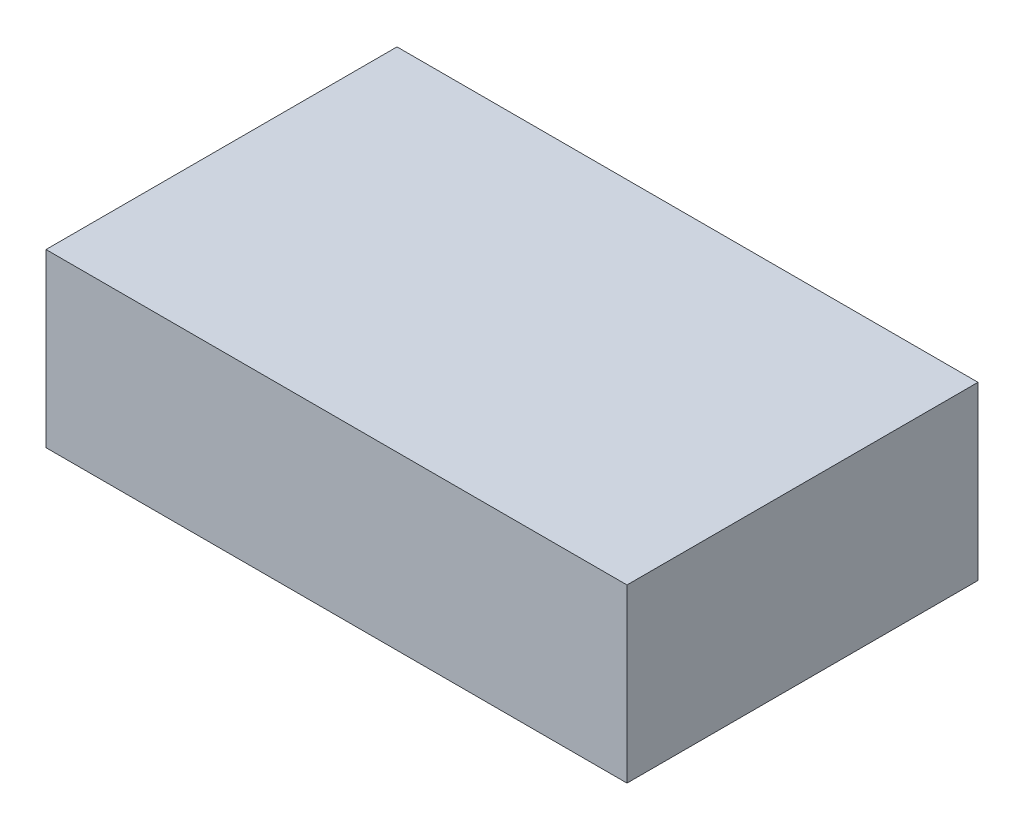
ISO-10303-21;
HEADER;
FILE_DESCRIPTION(('STEP AP214'),'2;1');
FILE_NAME('part.step','',(''),(''),'','','');
FILE_SCHEMA(('AUTOMOTIVE_DESIGN { 1 0 10303 214 1 1 1 1 }'));
ENDSEC;
DATA;
#1=APPLICATION_CONTEXT('core data for automotive mechanical design processes');
#2=APPLICATION_PROTOCOL_DEFINITION('international standard','automotive_design',2000,#1);
#3=PRODUCT_CONTEXT('',#1,'mechanical');
#4=PRODUCT('Part','Part','',(#3));
#5=PRODUCT_RELATED_PRODUCT_CATEGORY('part','',(#4));
#6=PRODUCT_DEFINITION_FORMATION('','',#4);
#7=PRODUCT_DEFINITION_CONTEXT('part definition',#1,'design');
#8=PRODUCT_DEFINITION('design','',#6,#7);
#9=PRODUCT_DEFINITION_SHAPE('','',#8);
#10=(LENGTH_UNIT() NAMED_UNIT(*) SI_UNIT(.MILLI.,.METRE.));
#11=(NAMED_UNIT(*) PLANE_ANGLE_UNIT() SI_UNIT($,.RADIAN.));
#12=(NAMED_UNIT(*) SI_UNIT($,.STERADIAN.) SOLID_ANGLE_UNIT());
#13=UNCERTAINTY_MEASURE_WITH_UNIT(LENGTH_MEASURE(1.E-05),#10,'distance_accuracy_value','');
#14=(GEOMETRIC_REPRESENTATION_CONTEXT(3) GLOBAL_UNCERTAINTY_ASSIGNED_CONTEXT((#13)) GLOBAL_UNIT_ASSIGNED_CONTEXT((#10,
#11,#12)) REPRESENTATION_CONTEXT('',''));
#15=CARTESIAN_POINT('',(0.,0.,0.));
#16=DIRECTION('',(0.,0.,1.));
#17=DIRECTION('',(1.,0.,0.));
#18=AXIS2_PLACEMENT_3D('',#15,#16,#17);
#19=CARTESIAN_POINT('',(0.,0.,0.));
#20=DIRECTION('',(0.,1.,0.));
#21=DIRECTION('',(0.,0.,1.));
#22=AXIS2_PLACEMENT_3D('',#19,#20,#21);
#23=PLANE('',#22);
#24=DIRECTION('',(-1.,0.,0.));
#25=VECTOR('',#24,1.);
#26=CARTESIAN_POINT('',(6.83134000749649,0.,8.49935928674607));
#27=LINE('',#26,#25);
#28=CARTESIAN_POINT('',(11.9085697150357,0.,8.49935928674607));
#29=VERTEX_POINT('',#28);
#30=CARTESIAN_POINT('',(6.83134000749649,0.,8.49935928674607));
#31=VERTEX_POINT('',#30);
#32=EDGE_CURVE('E82',#29,#31,#27,.T.);
#33=ORIENTED_EDGE('',*,*,#32,.T.);
#34=DIRECTION('',(0.,0.,1.));
#35=VECTOR('',#34,1.);
#36=CARTESIAN_POINT('',(6.83134000749649,0.,8.49935928674607));
#37=LINE('',#36,#35);
#38=CARTESIAN_POINT('',(6.83134000749649,0.,11.5666840703151));
#39=VERTEX_POINT('',#38);
#40=EDGE_CURVE('E97',#31,#39,#37,.T.);
#41=ORIENTED_EDGE('',*,*,#40,.T.);
#42=DIRECTION('',(1.,0.,0.));
#43=VECTOR('',#42,1.);
#44=CARTESIAN_POINT('',(6.83134000749649,0.,11.5666840703151));
#45=LINE('',#44,#43);
#46=CARTESIAN_POINT('',(11.9085697150357,0.,11.5666840703151));
#47=VERTEX_POINT('',#46);
#48=EDGE_CURVE('E100',#39,#47,#45,.T.);
#49=ORIENTED_EDGE('',*,*,#48,.T.);
#50=DIRECTION('',(0.,0.,-1.));
#51=VECTOR('',#50,1.);
#52=CARTESIAN_POINT('',(11.9085697150357,0.,8.49935928674607));
#53=LINE('',#52,#51);
#54=EDGE_CURVE('E60',#47,#29,#53,.T.);
#55=ORIENTED_EDGE('',*,*,#54,.T.);
#56=EDGE_LOOP('',(#33,#41,#49,#55));
#57=FACE_BOUND('',#56,.T.);
#58=ADVANCED_FACE('F36',(#57),#23,.T.);
#59=CARTESIAN_POINT('',(6.83134000749649,-1.5,8.49935928674607));
#60=DIRECTION('',(-1.,0.,0.));
#61=DIRECTION('',(0.,0.,1.));
#62=AXIS2_PLACEMENT_3D('',#59,#60,#61);
#63=PLANE('',#62);
#64=ORIENTED_EDGE('',*,*,#40,.F.);
#65=DIRECTION('',(0.,1.,0.));
#66=VECTOR('',#65,1.);
#67=CARTESIAN_POINT('',(6.83134000749649,-1.5,8.49935928674607));
#68=LINE('',#67,#66);
#69=CARTESIAN_POINT('',(6.83134000749649,-1.5,8.49935928674607));
#70=VERTEX_POINT('',#69);
#71=EDGE_CURVE('E11',#70,#31,#68,.T.);
#72=ORIENTED_EDGE('',*,*,#71,.F.);
#73=DIRECTION('',(0.,0.,1.));
#74=VECTOR('',#73,1.);
#75=CARTESIAN_POINT('',(6.83134000749649,-1.5,8.49935928674607));
#76=LINE('',#75,#74);
#77=CARTESIAN_POINT('',(6.83134000749649,-1.5,11.5666840703151));
#78=VERTEX_POINT('',#77);
#79=EDGE_CURVE('E52',#70,#78,#76,.T.);
#80=ORIENTED_EDGE('',*,*,#79,.T.);
#81=DIRECTION('',(0.,1.,0.));
#82=VECTOR('',#81,1.);
#83=CARTESIAN_POINT('',(6.83134000749649,-1.5,11.5666840703151));
#84=LINE('',#83,#82);
#85=EDGE_CURVE('E39',#78,#39,#84,.T.);
#86=ORIENTED_EDGE('',*,*,#85,.T.);
#87=EDGE_LOOP('',(#64,#72,#80,#86));
#88=FACE_BOUND('',#87,.T.);
#89=ADVANCED_FACE('F109',(#88),#63,.T.);
#90=CARTESIAN_POINT('',(6.83134000749649,-1.5,8.49935928674607));
#91=DIRECTION('',(0.,0.,-1.));
#92=DIRECTION('',(-1.,0.,0.));
#93=AXIS2_PLACEMENT_3D('',#90,#91,#92);
#94=PLANE('',#93);
#95=ORIENTED_EDGE('',*,*,#32,.F.);
#96=DIRECTION('',(0.,1.,0.));
#97=VECTOR('',#96,1.);
#98=CARTESIAN_POINT('',(11.9085697150357,-1.5,8.49935928674607));
#99=LINE('',#98,#97);
#100=CARTESIAN_POINT('',(11.9085697150357,-1.5,8.49935928674607));
#101=VERTEX_POINT('',#100);
#102=EDGE_CURVE('E44',#101,#29,#99,.T.);
#103=ORIENTED_EDGE('',*,*,#102,.F.);
#104=DIRECTION('',(-1.,0.,0.));
#105=VECTOR('',#104,1.);
#106=CARTESIAN_POINT('',(6.83134000749649,-1.5,8.49935928674607));
#107=LINE('',#106,#105);
#108=EDGE_CURVE('E80',#101,#70,#107,.T.);
#109=ORIENTED_EDGE('',*,*,#108,.T.);
#110=ORIENTED_EDGE('',*,*,#71,.T.);
#111=EDGE_LOOP('',(#95,#103,#109,#110));
#112=FACE_BOUND('',#111,.T.);
#113=ADVANCED_FACE('F78',(#112),#94,.T.);
#114=CARTESIAN_POINT('',(11.9085697150357,-1.5,8.49935928674607));
#115=DIRECTION('',(1.,0.,0.));
#116=DIRECTION('',(0.,0.,-1.));
#117=AXIS2_PLACEMENT_3D('',#114,#115,#116);
#118=PLANE('',#117);
#119=ORIENTED_EDGE('',*,*,#54,.F.);
#120=DIRECTION('',(0.,1.,0.));
#121=VECTOR('',#120,1.);
#122=CARTESIAN_POINT('',(11.9085697150357,-1.5,11.5666840703151));
#123=LINE('',#122,#121);
#124=CARTESIAN_POINT('',(11.9085697150357,-1.5,11.5666840703151));
#125=VERTEX_POINT('',#124);
#126=EDGE_CURVE('E83',#125,#47,#123,.T.);
#127=ORIENTED_EDGE('',*,*,#126,.F.);
#128=DIRECTION('',(0.,0.,-1.));
#129=VECTOR('',#128,1.);
#130=CARTESIAN_POINT('',(11.9085697150357,-1.5,8.49935928674607));
#131=LINE('',#130,#129);
#132=EDGE_CURVE('E86',#125,#101,#131,.T.);
#133=ORIENTED_EDGE('',*,*,#132,.T.);
#134=ORIENTED_EDGE('',*,*,#102,.T.);
#135=EDGE_LOOP('',(#119,#127,#133,#134));
#136=FACE_BOUND('',#135,.T.);
#137=ADVANCED_FACE('F87',(#136),#118,.T.);
#138=CARTESIAN_POINT('',(6.83134000749649,-1.5,11.5666840703151));
#139=DIRECTION('',(0.,0.,1.));
#140=DIRECTION('',(1.,0.,0.));
#141=AXIS2_PLACEMENT_3D('',#138,#139,#140);
#142=PLANE('',#141);
#143=ORIENTED_EDGE('',*,*,#48,.F.);
#144=ORIENTED_EDGE('',*,*,#85,.F.);
#145=DIRECTION('',(1.,0.,0.));
#146=VECTOR('',#145,1.);
#147=CARTESIAN_POINT('',(6.83134000749649,-1.5,11.5666840703151));
#148=LINE('',#147,#146);
#149=EDGE_CURVE('E91',#78,#125,#148,.T.);
#150=ORIENTED_EDGE('',*,*,#149,.T.);
#151=ORIENTED_EDGE('',*,*,#126,.T.);
#152=EDGE_LOOP('',(#143,#144,#150,#151));
#153=FACE_BOUND('',#152,.T.);
#154=ADVANCED_FACE('F106',(#153),#142,.T.);
#155=CARTESIAN_POINT('',(0.,-1.5,0.));
#156=DIRECTION('',(0.,1.,0.));
#157=DIRECTION('',(0.,0.,1.));
#158=AXIS2_PLACEMENT_3D('',#155,#156,#157);
#159=PLANE('',#158);
#160=ORIENTED_EDGE('',*,*,#79,.F.);
#161=ORIENTED_EDGE('',*,*,#108,.F.);
#162=ORIENTED_EDGE('',*,*,#132,.F.);
#163=ORIENTED_EDGE('',*,*,#149,.F.);
#164=EDGE_LOOP('',(#160,#161,#162,#163));
#165=FACE_BOUND('',#164,.T.);
#166=ADVANCED_FACE('F93',(#165),#159,.F.);
#167=CLOSED_SHELL('',(#58,#89,#113,#137,#154,#166));
#168=MANIFOLD_SOLID_BREP('B2',#167);
#169=ADVANCED_BREP_SHAPE_REPRESENTATION('',(#18,#168),#14);
#170=SHAPE_DEFINITION_REPRESENTATION(#9,#169);
ENDSEC;
END-ISO-10303-21;
